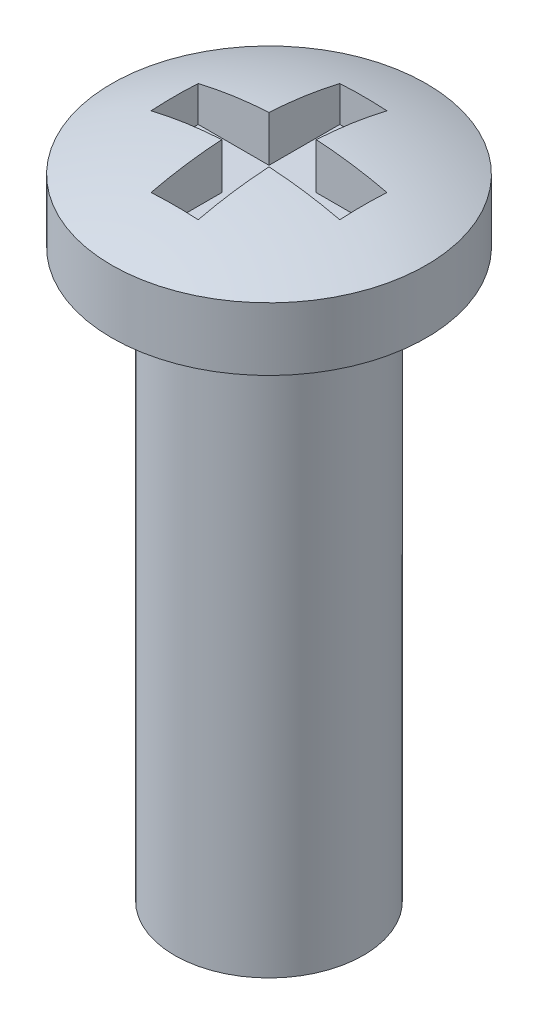
ISO-10303-21;
HEADER;
FILE_DESCRIPTION(('STEP AP214'),'2;1');
FILE_NAME('part.step','',(''),(''),'','','');
FILE_SCHEMA(('AUTOMOTIVE_DESIGN { 1 0 10303 214 1 1 1 1 }'));
ENDSEC;
DATA;
#1=APPLICATION_CONTEXT('core data for automotive mechanical design processes');
#2=APPLICATION_PROTOCOL_DEFINITION('international standard','automotive_design',2000,#1);
#3=PRODUCT_CONTEXT('',#1,'mechanical');
#4=PRODUCT('Part','Part','',(#3));
#5=PRODUCT_RELATED_PRODUCT_CATEGORY('part','',(#4));
#6=PRODUCT_DEFINITION_FORMATION('','',#4);
#7=PRODUCT_DEFINITION_CONTEXT('part definition',#1,'design');
#8=PRODUCT_DEFINITION('design','',#6,#7);
#9=PRODUCT_DEFINITION_SHAPE('','',#8);
#10=(LENGTH_UNIT() NAMED_UNIT(*) SI_UNIT(.MILLI.,.METRE.));
#11=(NAMED_UNIT(*) PLANE_ANGLE_UNIT() SI_UNIT($,.RADIAN.));
#12=(NAMED_UNIT(*) SI_UNIT($,.STERADIAN.) SOLID_ANGLE_UNIT());
#13=UNCERTAINTY_MEASURE_WITH_UNIT(LENGTH_MEASURE(1.E-05),#10,'distance_accuracy_value','');
#14=(GEOMETRIC_REPRESENTATION_CONTEXT(3) GLOBAL_UNCERTAINTY_ASSIGNED_CONTEXT((#13)) GLOBAL_UNIT_ASSIGNED_CONTEXT((#10,
#11,#12)) REPRESENTATION_CONTEXT('',''));
#15=CARTESIAN_POINT('',(0.,0.,0.));
#16=DIRECTION('',(0.,0.,1.));
#17=DIRECTION('',(1.,0.,0.));
#18=AXIS2_PLACEMENT_3D('',#15,#16,#17);
#19=CARTESIAN_POINT('',(0.,9.,0.));
#20=DIRECTION('',(0.,-1.,0.));
#21=DIRECTION('',(0.,0.,-1.));
#22=AXIS2_PLACEMENT_3D('',#19,#20,#21);
#23=CYLINDRICAL_SURFACE('',#22,1.5);
#24=CARTESIAN_POINT('',(0.,9.,0.));
#25=DIRECTION('',(0.,1.,0.));
#26=DIRECTION('',(0.,0.,1.));
#27=AXIS2_PLACEMENT_3D('',#24,#25,#26);
#28=CIRCLE('',#27,1.5);
#29=CARTESIAN_POINT('',(0.,9.,1.5));
#30=VERTEX_POINT('',#29);
#31=EDGE_CURVE('E197',#30,#30,#28,.T.);
#32=ORIENTED_EDGE('',*,*,#31,.F.);
#33=EDGE_LOOP('',(#32));
#34=FACE_BOUND('',#33,.T.);
#35=CARTESIAN_POINT('',(0.,0.,0.));
#36=DIRECTION('',(0.,1.,0.));
#37=DIRECTION('',(0.,0.,1.));
#38=AXIS2_PLACEMENT_3D('',#35,#36,#37);
#39=CIRCLE('',#38,1.5);
#40=CARTESIAN_POINT('',(0.,0.,1.5));
#41=VERTEX_POINT('',#40);
#42=EDGE_CURVE('E201',#41,#41,#39,.T.);
#43=ORIENTED_EDGE('',*,*,#42,.T.);
#44=EDGE_LOOP('',(#43));
#45=FACE_BOUND('',#44,.T.);
#46=ADVANCED_FACE('F34',(#34,#45),#23,.T.);
#47=CARTESIAN_POINT('',(0.,0.,0.));
#48=DIRECTION('',(0.,1.,0.));
#49=DIRECTION('',(0.,0.,1.));
#50=AXIS2_PLACEMENT_3D('',#47,#48,#49);
#51=PLANE('',#50);
#52=ORIENTED_EDGE('',*,*,#42,.F.);
#53=EDGE_LOOP('',(#52));
#54=FACE_BOUND('',#53,.T.);
#55=ADVANCED_FACE('F275',(#54),#51,.F.);
#56=CARTESIAN_POINT('',(0.,10.,0.));
#57=DIRECTION('',(0.,-1.,0.));
#58=DIRECTION('',(0.,0.,-1.));
#59=AXIS2_PLACEMENT_3D('',#56,#57,#58);
#60=CYLINDRICAL_SURFACE('',#59,2.5);
#61=CARTESIAN_POINT('',(0.,10.,0.));
#62=DIRECTION('',(0.,1.,0.));
#63=DIRECTION('',(0.,0.,1.));
#64=AXIS2_PLACEMENT_3D('',#61,#62,#63);
#65=CIRCLE('',#64,2.5);
#66=CARTESIAN_POINT('',(0.,10.,2.5));
#67=VERTEX_POINT('',#66);
#68=EDGE_CURVE('E196',#67,#67,#65,.T.);
#69=ORIENTED_EDGE('',*,*,#68,.F.);
#70=EDGE_LOOP('',(#69));
#71=FACE_BOUND('',#70,.T.);
#72=CARTESIAN_POINT('',(0.,9.,0.));
#73=DIRECTION('',(0.,1.,0.));
#74=DIRECTION('',(0.,0.,1.));
#75=AXIS2_PLACEMENT_3D('',#72,#73,#74);
#76=CIRCLE('',#75,2.5);
#77=CARTESIAN_POINT('',(0.,9.,2.5));
#78=VERTEX_POINT('',#77);
#79=EDGE_CURVE('E166',#78,#78,#76,.T.);
#80=ORIENTED_EDGE('',*,*,#79,.T.);
#81=EDGE_LOOP('',(#80));
#82=FACE_BOUND('',#81,.T.);
#83=ADVANCED_FACE('F280',(#71,#82),#60,.T.);
#84=CARTESIAN_POINT('',(0.,4.,0.));
#85=DIRECTION('',(0.,0.,1.));
#86=DIRECTION('',(1.,0.,0.));
#87=AXIS2_PLACEMENT_3D('',#84,#85,#86);
#88=SPHERICAL_SURFACE('',#87,6.49999999999999);
#89=CARTESIAN_POINT('',(0.,4.,0.375));
#90=DIRECTION('',(0.,0.,1.));
#91=DIRECTION('',(1.,0.,0.));
#92=AXIS2_PLACEMENT_3D('',#89,#90,#91);
#93=CIRCLE('',#92,6.4891736762087);
#94=CARTESIAN_POINT('',(-1.5,10.3134281495872,0.375));
#95=VERTEX_POINT('',#94);
#96=CARTESIAN_POINT('',(-0.375,10.478329259925,0.375));
#97=VERTEX_POINT('',#96);
#98=EDGE_CURVE('E11',#95,#97,#93,.F.);
#99=ORIENTED_EDGE('',*,*,#98,.F.);
#100=CARTESIAN_POINT('',(-1.5,4.,0.));
#101=DIRECTION('',(-1.,0.,0.));
#102=DIRECTION('',(0.,0.,1.));
#103=AXIS2_PLACEMENT_3D('',#100,#101,#102);
#104=CIRCLE('',#103,6.32455532033675);
#105=CARTESIAN_POINT('',(-1.5,10.3134281495872,-0.375));
#106=VERTEX_POINT('',#105);
#107=EDGE_CURVE('E42',#106,#95,#104,.F.);
#108=ORIENTED_EDGE('',*,*,#107,.F.);
#109=CARTESIAN_POINT('',(0.,4.,-0.375));
#110=DIRECTION('',(0.,0.,1.));
#111=DIRECTION('',(1.,0.,0.));
#112=AXIS2_PLACEMENT_3D('',#109,#110,#111);
#113=CIRCLE('',#112,6.4891736762087);
#114=CARTESIAN_POINT('',(-0.375,10.478329259925,-0.375));
#115=VERTEX_POINT('',#114);
#116=EDGE_CURVE('E228',#106,#115,#113,.F.);
#117=ORIENTED_EDGE('',*,*,#116,.T.);
#118=CARTESIAN_POINT('',(-0.375,4.,0.));
#119=DIRECTION('',(-1.,0.,0.));
#120=DIRECTION('',(0.,0.,1.));
#121=AXIS2_PLACEMENT_3D('',#118,#119,#120);
#122=CIRCLE('',#121,6.4891736762087);
#123=CARTESIAN_POINT('',(-0.375,10.3134281495872,-1.5));
#124=VERTEX_POINT('',#123);
#125=EDGE_CURVE('E226',#124,#115,#122,.F.);
#126=ORIENTED_EDGE('',*,*,#125,.F.);
#127=CARTESIAN_POINT('',(0.,4.,-1.5));
#128=DIRECTION('',(0.,0.,1.));
#129=DIRECTION('',(1.,0.,0.));
#130=AXIS2_PLACEMENT_3D('',#127,#128,#129);
#131=CIRCLE('',#130,6.32455532033675);
#132=CARTESIAN_POINT('',(0.375,10.3134281495872,-1.5));
#133=VERTEX_POINT('',#132);
#134=EDGE_CURVE('E223',#124,#133,#131,.F.);
#135=ORIENTED_EDGE('',*,*,#134,.T.);
#136=CARTESIAN_POINT('',(0.375,4.,0.));
#137=DIRECTION('',(-1.,0.,0.));
#138=DIRECTION('',(0.,0.,1.));
#139=AXIS2_PLACEMENT_3D('',#136,#137,#138);
#140=CIRCLE('',#139,6.4891736762087);
#141=CARTESIAN_POINT('',(0.375,10.478329259925,-0.375));
#142=VERTEX_POINT('',#141);
#143=EDGE_CURVE('E220',#133,#142,#140,.F.);
#144=ORIENTED_EDGE('',*,*,#143,.T.);
#145=CARTESIAN_POINT('',(0.,4.,-0.375));
#146=DIRECTION('',(0.,0.,1.));
#147=DIRECTION('',(1.,0.,0.));
#148=AXIS2_PLACEMENT_3D('',#145,#146,#147);
#149=CIRCLE('',#148,6.4891736762087);
#150=CARTESIAN_POINT('',(1.5,10.3134281495872,-0.375));
#151=VERTEX_POINT('',#150);
#152=EDGE_CURVE('E217',#142,#151,#149,.F.);
#153=ORIENTED_EDGE('',*,*,#152,.T.);
#154=CARTESIAN_POINT('',(1.5,4.,0.));
#155=DIRECTION('',(-1.,0.,0.));
#156=DIRECTION('',(0.,0.,1.));
#157=AXIS2_PLACEMENT_3D('',#154,#155,#156);
#158=CIRCLE('',#157,6.32455532033675);
#159=CARTESIAN_POINT('',(1.5,10.3134281495872,0.375));
#160=VERTEX_POINT('',#159);
#161=EDGE_CURVE('E214',#151,#160,#158,.F.);
#162=ORIENTED_EDGE('',*,*,#161,.T.);
#163=CARTESIAN_POINT('',(0.,4.,0.375));
#164=DIRECTION('',(0.,0.,1.));
#165=DIRECTION('',(1.,0.,0.));
#166=AXIS2_PLACEMENT_3D('',#163,#164,#165);
#167=CIRCLE('',#166,6.4891736762087);
#168=CARTESIAN_POINT('',(0.375,10.478329259925,0.375));
#169=VERTEX_POINT('',#168);
#170=EDGE_CURVE('E212',#169,#160,#167,.F.);
#171=ORIENTED_EDGE('',*,*,#170,.F.);
#172=CARTESIAN_POINT('',(0.375,4.,0.));
#173=DIRECTION('',(-1.,0.,0.));
#174=DIRECTION('',(0.,0.,1.));
#175=AXIS2_PLACEMENT_3D('',#172,#173,#174);
#176=CIRCLE('',#175,6.4891736762087);
#177=CARTESIAN_POINT('',(0.375,10.3134281495872,1.5));
#178=VERTEX_POINT('',#177);
#179=EDGE_CURVE('E209',#169,#178,#176,.F.);
#180=ORIENTED_EDGE('',*,*,#179,.T.);
#181=CARTESIAN_POINT('',(0.,4.,1.5));
#182=DIRECTION('',(0.,0.,1.));
#183=DIRECTION('',(1.,0.,0.));
#184=AXIS2_PLACEMENT_3D('',#181,#182,#183);
#185=CIRCLE('',#184,6.32455532033675);
#186=CARTESIAN_POINT('',(-0.375,10.3134281495872,1.5));
#187=VERTEX_POINT('',#186);
#188=EDGE_CURVE('E207',#187,#178,#185,.F.);
#189=ORIENTED_EDGE('',*,*,#188,.F.);
#190=CARTESIAN_POINT('',(-0.375,4.,0.));
#191=DIRECTION('',(-1.,0.,0.));
#192=DIRECTION('',(0.,0.,1.));
#193=AXIS2_PLACEMENT_3D('',#190,#191,#192);
#194=CIRCLE('',#193,6.4891736762087);
#195=EDGE_CURVE('E200',#97,#187,#194,.F.);
#196=ORIENTED_EDGE('',*,*,#195,.F.);
#197=EDGE_LOOP('',(#99,#108,#117,#126,#135,#144,#153,#162,#171,#180,#189,#196));
#198=FACE_BOUND('',#197,.T.);
#199=ORIENTED_EDGE('',*,*,#68,.T.);
#200=EDGE_LOOP('',(#199));
#201=FACE_BOUND('',#200,.T.);
#202=ADVANCED_FACE('F36',(#198,#201),#88,.T.);
#203=CARTESIAN_POINT('',(0.,9.,0.));
#204=DIRECTION('',(0.,1.,0.));
#205=DIRECTION('',(0.,0.,1.));
#206=AXIS2_PLACEMENT_3D('',#203,#204,#205);
#207=PLANE('',#206);
#208=ORIENTED_EDGE('',*,*,#31,.T.);
#209=EDGE_LOOP('',(#208));
#210=FACE_BOUND('',#209,.T.);
#211=ORIENTED_EDGE('',*,*,#79,.F.);
#212=EDGE_LOOP('',(#211));
#213=FACE_BOUND('',#212,.T.);
#214=ADVANCED_FACE('F289',(#210,#213),#207,.F.);
#215=CARTESIAN_POINT('',(0.,9.75,0.375));
#216=DIRECTION('',(0.,0.,1.));
#217=DIRECTION('',(1.,0.,0.));
#218=AXIS2_PLACEMENT_3D('',#215,#216,#217);
#219=PLANE('',#218);
#220=ORIENTED_EDGE('',*,*,#98,.T.);
#221=DIRECTION('',(0.,1.,0.));
#222=VECTOR('',#221,1.);
#223=CARTESIAN_POINT('',(-0.375,9.75,0.375));
#224=LINE('',#223,#222);
#225=CARTESIAN_POINT('',(-0.375,9.75,0.375));
#226=VERTEX_POINT('',#225);
#227=EDGE_CURVE('E49',#226,#97,#224,.T.);
#228=ORIENTED_EDGE('',*,*,#227,.F.);
#229=DIRECTION('',(1.,0.,0.));
#230=VECTOR('',#229,1.);
#231=CARTESIAN_POINT('',(0.,9.75,0.375));
#232=LINE('',#231,#230);
#233=CARTESIAN_POINT('',(-1.5,9.75,0.375));
#234=VERTEX_POINT('',#233);
#235=EDGE_CURVE('E123',#234,#226,#232,.T.);
#236=ORIENTED_EDGE('',*,*,#235,.F.);
#237=DIRECTION('',(0.,1.,0.));
#238=VECTOR('',#237,1.);
#239=CARTESIAN_POINT('',(-1.5,9.75,0.375));
#240=LINE('',#239,#238);
#241=EDGE_CURVE('E164',#234,#95,#240,.T.);
#242=ORIENTED_EDGE('',*,*,#241,.T.);
#243=EDGE_LOOP('',(#220,#228,#236,#242));
#244=FACE_BOUND('',#243,.T.);
#245=ADVANCED_FACE('F121',(#244),#219,.F.);
#246=CARTESIAN_POINT('',(-1.5,9.75,0.));
#247=DIRECTION('',(-1.,0.,0.));
#248=DIRECTION('',(0.,0.,1.));
#249=AXIS2_PLACEMENT_3D('',#246,#247,#248);
#250=PLANE('',#249);
#251=ORIENTED_EDGE('',*,*,#107,.T.);
#252=ORIENTED_EDGE('',*,*,#241,.F.);
#253=DIRECTION('',(0.,0.,1.));
#254=VECTOR('',#253,1.);
#255=CARTESIAN_POINT('',(-1.5,9.75,0.));
#256=LINE('',#255,#254);
#257=CARTESIAN_POINT('',(-1.5,9.75,-0.375));
#258=VERTEX_POINT('',#257);
#259=EDGE_CURVE('E128',#258,#234,#256,.T.);
#260=ORIENTED_EDGE('',*,*,#259,.F.);
#261=DIRECTION('',(0.,1.,0.));
#262=VECTOR('',#261,1.);
#263=CARTESIAN_POINT('',(-1.5,9.75,-0.375));
#264=LINE('',#263,#262);
#265=EDGE_CURVE('E167',#258,#106,#264,.T.);
#266=ORIENTED_EDGE('',*,*,#265,.T.);
#267=EDGE_LOOP('',(#251,#252,#260,#266));
#268=FACE_BOUND('',#267,.T.);
#269=ADVANCED_FACE('F236',(#268),#250,.F.);
#270=CARTESIAN_POINT('',(0.,9.75,-0.375));
#271=DIRECTION('',(0.,0.,1.));
#272=DIRECTION('',(1.,0.,0.));
#273=AXIS2_PLACEMENT_3D('',#270,#271,#272);
#274=PLANE('',#273);
#275=ORIENTED_EDGE('',*,*,#265,.F.);
#276=DIRECTION('',(1.,0.,0.));
#277=VECTOR('',#276,1.);
#278=CARTESIAN_POINT('',(0.,9.75,-0.375));
#279=LINE('',#278,#277);
#280=CARTESIAN_POINT('',(-0.375,9.75,-0.375));
#281=VERTEX_POINT('',#280);
#282=EDGE_CURVE('E161',#258,#281,#279,.T.);
#283=ORIENTED_EDGE('',*,*,#282,.T.);
#284=DIRECTION('',(0.,1.,0.));
#285=VECTOR('',#284,1.);
#286=CARTESIAN_POINT('',(-0.375,9.75,-0.375));
#287=LINE('',#286,#285);
#288=EDGE_CURVE('E169',#281,#115,#287,.T.);
#289=ORIENTED_EDGE('',*,*,#288,.T.);
#290=ORIENTED_EDGE('',*,*,#116,.F.);
#291=EDGE_LOOP('',(#275,#283,#289,#290));
#292=FACE_BOUND('',#291,.T.);
#293=ADVANCED_FACE('F234',(#292),#274,.T.);
#294=CARTESIAN_POINT('',(-0.375,9.75,0.));
#295=DIRECTION('',(-1.,0.,0.));
#296=DIRECTION('',(0.,0.,1.));
#297=AXIS2_PLACEMENT_3D('',#294,#295,#296);
#298=PLANE('',#297);
#299=ORIENTED_EDGE('',*,*,#125,.T.);
#300=ORIENTED_EDGE('',*,*,#288,.F.);
#301=DIRECTION('',(0.,0.,1.));
#302=VECTOR('',#301,1.);
#303=CARTESIAN_POINT('',(-0.375,9.75,0.));
#304=LINE('',#303,#302);
#305=CARTESIAN_POINT('',(-0.375,9.75,-1.5));
#306=VERTEX_POINT('',#305);
#307=EDGE_CURVE('E158',#306,#281,#304,.T.);
#308=ORIENTED_EDGE('',*,*,#307,.F.);
#309=DIRECTION('',(0.,1.,0.));
#310=VECTOR('',#309,1.);
#311=CARTESIAN_POINT('',(-0.375,9.75,-1.5));
#312=LINE('',#311,#310);
#313=EDGE_CURVE('E172',#306,#124,#312,.T.);
#314=ORIENTED_EDGE('',*,*,#313,.T.);
#315=EDGE_LOOP('',(#299,#300,#308,#314));
#316=FACE_BOUND('',#315,.T.);
#317=ADVANCED_FACE('F264',(#316),#298,.F.);
#318=CARTESIAN_POINT('',(0.,9.75,-1.5));
#319=DIRECTION('',(0.,0.,1.));
#320=DIRECTION('',(1.,0.,0.));
#321=AXIS2_PLACEMENT_3D('',#318,#319,#320);
#322=PLANE('',#321);
#323=ORIENTED_EDGE('',*,*,#313,.F.);
#324=DIRECTION('',(1.,0.,0.));
#325=VECTOR('',#324,1.);
#326=CARTESIAN_POINT('',(0.,9.75,-1.5));
#327=LINE('',#326,#325);
#328=CARTESIAN_POINT('',(0.375,9.75,-1.5));
#329=VERTEX_POINT('',#328);
#330=EDGE_CURVE('E156',#306,#329,#327,.T.);
#331=ORIENTED_EDGE('',*,*,#330,.T.);
#332=DIRECTION('',(0.,1.,0.));
#333=VECTOR('',#332,1.);
#334=CARTESIAN_POINT('',(0.375,9.75,-1.5));
#335=LINE('',#334,#333);
#336=EDGE_CURVE('E175',#329,#133,#335,.T.);
#337=ORIENTED_EDGE('',*,*,#336,.T.);
#338=ORIENTED_EDGE('',*,*,#134,.F.);
#339=EDGE_LOOP('',(#323,#331,#337,#338));
#340=FACE_BOUND('',#339,.T.);
#341=ADVANCED_FACE('F265',(#340),#322,.T.);
#342=CARTESIAN_POINT('',(0.375,9.75,0.));
#343=DIRECTION('',(-1.,0.,0.));
#344=DIRECTION('',(0.,0.,1.));
#345=AXIS2_PLACEMENT_3D('',#342,#343,#344);
#346=PLANE('',#345);
#347=ORIENTED_EDGE('',*,*,#336,.F.);
#348=DIRECTION('',(0.,0.,1.));
#349=VECTOR('',#348,1.);
#350=CARTESIAN_POINT('',(0.375,9.75,0.));
#351=LINE('',#350,#349);
#352=CARTESIAN_POINT('',(0.375,9.75,-0.375));
#353=VERTEX_POINT('',#352);
#354=EDGE_CURVE('E154',#329,#353,#351,.T.);
#355=ORIENTED_EDGE('',*,*,#354,.T.);
#356=DIRECTION('',(0.,1.,0.));
#357=VECTOR('',#356,1.);
#358=CARTESIAN_POINT('',(0.375,9.75,-0.375));
#359=LINE('',#358,#357);
#360=EDGE_CURVE('E178',#353,#142,#359,.T.);
#361=ORIENTED_EDGE('',*,*,#360,.T.);
#362=ORIENTED_EDGE('',*,*,#143,.F.);
#363=EDGE_LOOP('',(#347,#355,#361,#362));
#364=FACE_BOUND('',#363,.T.);
#365=ADVANCED_FACE('F258',(#364),#346,.T.);
#366=CARTESIAN_POINT('',(0.,9.75,-0.375));
#367=DIRECTION('',(0.,0.,1.));
#368=DIRECTION('',(1.,0.,0.));
#369=AXIS2_PLACEMENT_3D('',#366,#367,#368);
#370=PLANE('',#369);
#371=ORIENTED_EDGE('',*,*,#360,.F.);
#372=DIRECTION('',(1.,0.,0.));
#373=VECTOR('',#372,1.);
#374=CARTESIAN_POINT('',(0.,9.75,-0.375));
#375=LINE('',#374,#373);
#376=CARTESIAN_POINT('',(1.5,9.75,-0.375));
#377=VERTEX_POINT('',#376);
#378=EDGE_CURVE('E152',#353,#377,#375,.T.);
#379=ORIENTED_EDGE('',*,*,#378,.T.);
#380=DIRECTION('',(0.,1.,0.));
#381=VECTOR('',#380,1.);
#382=CARTESIAN_POINT('',(1.5,9.75,-0.375));
#383=LINE('',#382,#381);
#384=EDGE_CURVE('E181',#377,#151,#383,.T.);
#385=ORIENTED_EDGE('',*,*,#384,.T.);
#386=ORIENTED_EDGE('',*,*,#152,.F.);
#387=EDGE_LOOP('',(#371,#379,#385,#386));
#388=FACE_BOUND('',#387,.T.);
#389=ADVANCED_FACE('F254',(#388),#370,.T.);
#390=CARTESIAN_POINT('',(1.5,9.75,0.));
#391=DIRECTION('',(-1.,0.,0.));
#392=DIRECTION('',(0.,0.,1.));
#393=AXIS2_PLACEMENT_3D('',#390,#391,#392);
#394=PLANE('',#393);
#395=ORIENTED_EDGE('',*,*,#384,.F.);
#396=DIRECTION('',(0.,0.,1.));
#397=VECTOR('',#396,1.);
#398=CARTESIAN_POINT('',(1.5,9.75,0.));
#399=LINE('',#398,#397);
#400=CARTESIAN_POINT('',(1.5,9.75,0.375));
#401=VERTEX_POINT('',#400);
#402=EDGE_CURVE('E150',#377,#401,#399,.T.);
#403=ORIENTED_EDGE('',*,*,#402,.T.);
#404=DIRECTION('',(0.,1.,0.));
#405=VECTOR('',#404,1.);
#406=CARTESIAN_POINT('',(1.5,9.75,0.375));
#407=LINE('',#406,#405);
#408=EDGE_CURVE('E184',#401,#160,#407,.T.);
#409=ORIENTED_EDGE('',*,*,#408,.T.);
#410=ORIENTED_EDGE('',*,*,#161,.F.);
#411=EDGE_LOOP('',(#395,#403,#409,#410));
#412=FACE_BOUND('',#411,.T.);
#413=ADVANCED_FACE('F251',(#412),#394,.T.);
#414=CARTESIAN_POINT('',(0.,9.75,0.375));
#415=DIRECTION('',(0.,0.,1.));
#416=DIRECTION('',(1.,0.,0.));
#417=AXIS2_PLACEMENT_3D('',#414,#415,#416);
#418=PLANE('',#417);
#419=ORIENTED_EDGE('',*,*,#170,.T.);
#420=ORIENTED_EDGE('',*,*,#408,.F.);
#421=DIRECTION('',(1.,0.,0.));
#422=VECTOR('',#421,1.);
#423=CARTESIAN_POINT('',(0.,9.75,0.375));
#424=LINE('',#423,#422);
#425=CARTESIAN_POINT('',(0.375,9.75,0.375));
#426=VERTEX_POINT('',#425);
#427=EDGE_CURVE('E147',#426,#401,#424,.T.);
#428=ORIENTED_EDGE('',*,*,#427,.F.);
#429=DIRECTION('',(0.,1.,0.));
#430=VECTOR('',#429,1.);
#431=CARTESIAN_POINT('',(0.375,9.75,0.375));
#432=LINE('',#431,#430);
#433=EDGE_CURVE('E187',#426,#169,#432,.T.);
#434=ORIENTED_EDGE('',*,*,#433,.T.);
#435=EDGE_LOOP('',(#419,#420,#428,#434));
#436=FACE_BOUND('',#435,.T.);
#437=ADVANCED_FACE('F247',(#436),#418,.F.);
#438=CARTESIAN_POINT('',(0.375,9.75,0.));
#439=DIRECTION('',(-1.,0.,0.));
#440=DIRECTION('',(0.,0.,1.));
#441=AXIS2_PLACEMENT_3D('',#438,#439,#440);
#442=PLANE('',#441);
#443=ORIENTED_EDGE('',*,*,#433,.F.);
#444=DIRECTION('',(0.,0.,1.));
#445=VECTOR('',#444,1.);
#446=CARTESIAN_POINT('',(0.375,9.75,0.));
#447=LINE('',#446,#445);
#448=CARTESIAN_POINT('',(0.375,9.75,1.5));
#449=VERTEX_POINT('',#448);
#450=EDGE_CURVE('E145',#426,#449,#447,.T.);
#451=ORIENTED_EDGE('',*,*,#450,.T.);
#452=DIRECTION('',(0.,1.,0.));
#453=VECTOR('',#452,1.);
#454=CARTESIAN_POINT('',(0.375,9.75,1.5));
#455=LINE('',#454,#453);
#456=EDGE_CURVE('E190',#449,#178,#455,.T.);
#457=ORIENTED_EDGE('',*,*,#456,.T.);
#458=ORIENTED_EDGE('',*,*,#179,.F.);
#459=EDGE_LOOP('',(#443,#451,#457,#458));
#460=FACE_BOUND('',#459,.T.);
#461=ADVANCED_FACE('F299',(#460),#442,.T.);
#462=CARTESIAN_POINT('',(0.,9.75,1.5));
#463=DIRECTION('',(0.,0.,1.));
#464=DIRECTION('',(1.,0.,0.));
#465=AXIS2_PLACEMENT_3D('',#462,#463,#464);
#466=PLANE('',#465);
#467=ORIENTED_EDGE('',*,*,#188,.T.);
#468=ORIENTED_EDGE('',*,*,#456,.F.);
#469=DIRECTION('',(1.,0.,0.));
#470=VECTOR('',#469,1.);
#471=CARTESIAN_POINT('',(0.,9.75,1.5));
#472=LINE('',#471,#470);
#473=CARTESIAN_POINT('',(-0.375,9.75,1.5));
#474=VERTEX_POINT('',#473);
#475=EDGE_CURVE('E137',#474,#449,#472,.T.);
#476=ORIENTED_EDGE('',*,*,#475,.F.);
#477=DIRECTION('',(0.,1.,0.));
#478=VECTOR('',#477,1.);
#479=CARTESIAN_POINT('',(-0.375,9.75,1.5));
#480=LINE('',#479,#478);
#481=EDGE_CURVE('E127',#474,#187,#480,.T.);
#482=ORIENTED_EDGE('',*,*,#481,.T.);
#483=EDGE_LOOP('',(#467,#468,#476,#482));
#484=FACE_BOUND('',#483,.T.);
#485=ADVANCED_FACE('F239',(#484),#466,.F.);
#486=CARTESIAN_POINT('',(-0.375,9.75,0.));
#487=DIRECTION('',(-1.,0.,0.));
#488=DIRECTION('',(0.,0.,1.));
#489=AXIS2_PLACEMENT_3D('',#486,#487,#488);
#490=PLANE('',#489);
#491=ORIENTED_EDGE('',*,*,#195,.T.);
#492=ORIENTED_EDGE('',*,*,#481,.F.);
#493=DIRECTION('',(0.,0.,1.));
#494=VECTOR('',#493,1.);
#495=CARTESIAN_POINT('',(-0.375,9.75,0.));
#496=LINE('',#495,#494);
#497=EDGE_CURVE('E131',#226,#474,#496,.T.);
#498=ORIENTED_EDGE('',*,*,#497,.F.);
#499=ORIENTED_EDGE('',*,*,#227,.T.);
#500=EDGE_LOOP('',(#491,#492,#498,#499));
#501=FACE_BOUND('',#500,.T.);
#502=ADVANCED_FACE('F132',(#501),#490,.F.);
#503=CARTESIAN_POINT('',(0.,9.75,0.));
#504=DIRECTION('',(0.,1.,0.));
#505=DIRECTION('',(0.,0.,1.));
#506=AXIS2_PLACEMENT_3D('',#503,#504,#505);
#507=PLANE('',#506);
#508=ORIENTED_EDGE('',*,*,#235,.T.);
#509=ORIENTED_EDGE('',*,*,#497,.T.);
#510=ORIENTED_EDGE('',*,*,#475,.T.);
#511=ORIENTED_EDGE('',*,*,#450,.F.);
#512=ORIENTED_EDGE('',*,*,#427,.T.);
#513=ORIENTED_EDGE('',*,*,#402,.F.);
#514=ORIENTED_EDGE('',*,*,#378,.F.);
#515=ORIENTED_EDGE('',*,*,#354,.F.);
#516=ORIENTED_EDGE('',*,*,#330,.F.);
#517=ORIENTED_EDGE('',*,*,#307,.T.);
#518=ORIENTED_EDGE('',*,*,#282,.F.);
#519=ORIENTED_EDGE('',*,*,#259,.T.);
#520=EDGE_LOOP('',(#508,#509,#510,#511,#512,#513,#514,#515,#516,#517,#518,#519));
#521=FACE_BOUND('',#520,.T.);
#522=ADVANCED_FACE('F139',(#521),#507,.T.);
#523=CLOSED_SHELL('',(#46,#55,#83,#202,#214,#245,#269,#293,#317,#341,#365,#389,#413,#437,#461,
#485,#502,#522));
#524=MANIFOLD_SOLID_BREP('B2',#523);
#525=ADVANCED_BREP_SHAPE_REPRESENTATION('',(#18,#524),#14);
#526=SHAPE_DEFINITION_REPRESENTATION(#9,#525);
ENDSEC;
END-ISO-10303-21;
